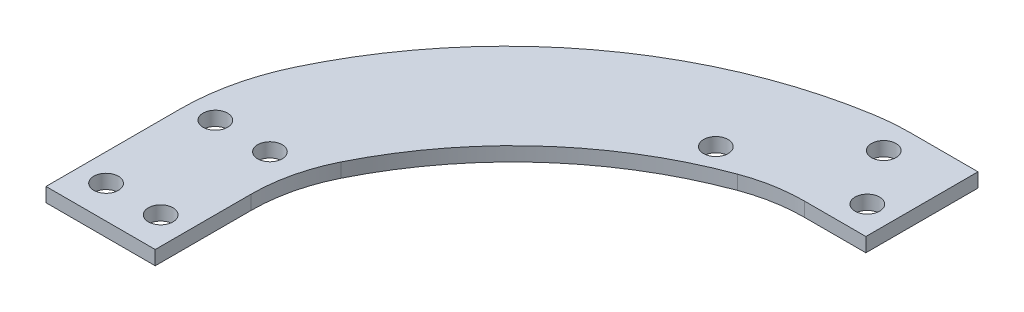
ISO-10303-21;
HEADER;
FILE_DESCRIPTION(('STEP AP214'),'2;1');
FILE_NAME('part.step','',(''),(''),'','','');
FILE_SCHEMA(('AUTOMOTIVE_DESIGN { 1 0 10303 214 1 1 1 1 }'));
ENDSEC;
DATA;
#1=APPLICATION_CONTEXT('core data for automotive mechanical design processes');
#2=APPLICATION_PROTOCOL_DEFINITION('international standard','automotive_design',2000,#1);
#3=PRODUCT_CONTEXT('',#1,'mechanical');
#4=PRODUCT('Part','Part','',(#3));
#5=PRODUCT_RELATED_PRODUCT_CATEGORY('part','',(#4));
#6=PRODUCT_DEFINITION_FORMATION('','',#4);
#7=PRODUCT_DEFINITION_CONTEXT('part definition',#1,'design');
#8=PRODUCT_DEFINITION('design','',#6,#7);
#9=PRODUCT_DEFINITION_SHAPE('','',#8);
#10=(LENGTH_UNIT() NAMED_UNIT(*) SI_UNIT(.MILLI.,.METRE.));
#11=(NAMED_UNIT(*) PLANE_ANGLE_UNIT() SI_UNIT($,.RADIAN.));
#12=(NAMED_UNIT(*) SI_UNIT($,.STERADIAN.) SOLID_ANGLE_UNIT());
#13=UNCERTAINTY_MEASURE_WITH_UNIT(LENGTH_MEASURE(1.E-05),#10,'distance_accuracy_value','');
#14=(GEOMETRIC_REPRESENTATION_CONTEXT(3) GLOBAL_UNCERTAINTY_ASSIGNED_CONTEXT((#13)) GLOBAL_UNIT_ASSIGNED_CONTEXT((#10,
#11,#12)) REPRESENTATION_CONTEXT('',''));
#15=CARTESIAN_POINT('',(0.,0.,0.));
#16=DIRECTION('',(0.,0.,1.));
#17=DIRECTION('',(1.,0.,0.));
#18=AXIS2_PLACEMENT_3D('',#15,#16,#17);
#19=CARTESIAN_POINT('',(60.7297478618746,2.58826,-31.65));
#20=DIRECTION('',(0.,-1.,0.));
#21=DIRECTION('',(0.,0.,-1.));
#22=AXIS2_PLACEMENT_3D('',#19,#20,#21);
#23=CYLINDRICAL_SURFACE('',#22,40.);
#24=CARTESIAN_POINT('',(60.7297478618746,0.,-31.65));
#25=DIRECTION('',(0.,1.,0.));
#26=DIRECTION('',(0.,0.,1.));
#27=AXIS2_PLACEMENT_3D('',#24,#25,#26);
#28=CIRCLE('',#27,40.);
#29=CARTESIAN_POINT('',(60.7297478618746,0.,-71.65));
#30=VERTEX_POINT('',#29);
#31=CARTESIAN_POINT('',(54.212761864157,0.,-71.1155405829637));
#32=VERTEX_POINT('',#31);
#33=EDGE_CURVE('E160',#30,#32,#28,.T.);
#34=ORIENTED_EDGE('',*,*,#33,.T.);
#35=DIRECTION('',(0.,-1.,0.));
#36=VECTOR('',#35,1.);
#37=CARTESIAN_POINT('',(54.212761864157,2.58826,-71.1155405829637));
#38=LINE('',#37,#36);
#39=CARTESIAN_POINT('',(54.212761864157,2.58826,-71.1155405829637));
#40=VERTEX_POINT('',#39);
#41=EDGE_CURVE('E11',#40,#32,#38,.T.);
#42=ORIENTED_EDGE('',*,*,#41,.F.);
#43=CARTESIAN_POINT('',(60.7297478618746,2.58826,-31.65));
#44=DIRECTION('',(0.,1.,0.));
#45=DIRECTION('',(0.,0.,1.));
#46=AXIS2_PLACEMENT_3D('',#43,#44,#45);
#47=CIRCLE('',#46,40.);
#48=CARTESIAN_POINT('',(60.7297478618746,2.58826,-71.65));
#49=VERTEX_POINT('',#48);
#50=EDGE_CURVE('E107',#49,#40,#47,.T.);
#51=ORIENTED_EDGE('',*,*,#50,.F.);
#52=DIRECTION('',(0.,-1.,0.));
#53=VECTOR('',#52,1.);
#54=CARTESIAN_POINT('',(60.7297478618746,2.58826,-71.65));
#55=LINE('',#54,#53);
#56=EDGE_CURVE('E159',#49,#30,#55,.T.);
#57=ORIENTED_EDGE('',*,*,#56,.T.);
#58=EDGE_LOOP('',(#34,#42,#51,#57));
#59=FACE_BOUND('',#58,.T.);
#60=ADVANCED_FACE('F40',(#59),#23,.T.);
#61=CARTESIAN_POINT('',(67.4957322096476,2.58826,9.32342390397192));
#62=DIRECTION('',(0.,-1.,0.));
#63=DIRECTION('',(0.,0.,-1.));
#64=AXIS2_PLACEMENT_3D('',#61,#62,#63);
#65=CYLINDRICAL_SURFACE('',#64,81.5283037290098);
#66=CARTESIAN_POINT('',(67.4957322096476,0.,9.32342390397192));
#67=DIRECTION('',(0.,1.,0.));
#68=DIRECTION('',(0.,0.,1.));
#69=AXIS2_PLACEMENT_3D('',#66,#67,#68);
#70=CIRCLE('',#69,81.5283037290098);
#71=CARTESIAN_POINT('',(-6.11583314774768,0.,-25.7222855989557));
#72=VERTEX_POINT('',#71);
#73=EDGE_CURVE('E163',#72,#32,#70,.F.);
#74=ORIENTED_EDGE('',*,*,#73,.F.);
#75=DIRECTION('',(0.,-1.,0.));
#76=VECTOR('',#75,1.);
#77=CARTESIAN_POINT('',(-6.11583314774768,2.58826,-25.7222855989557));
#78=LINE('',#77,#76);
#79=CARTESIAN_POINT('',(-6.11583314774768,2.58826,-25.7222855989557));
#80=VERTEX_POINT('',#79);
#81=EDGE_CURVE('E48',#80,#72,#78,.T.);
#82=ORIENTED_EDGE('',*,*,#81,.F.);
#83=CARTESIAN_POINT('',(67.4957322096476,2.58826,9.32342390397192));
#84=DIRECTION('',(0.,1.,0.));
#85=DIRECTION('',(0.,0.,1.));
#86=AXIS2_PLACEMENT_3D('',#83,#84,#85);
#87=CIRCLE('',#86,81.5283037290098);
#88=EDGE_CURVE('E220',#80,#40,#87,.F.);
#89=ORIENTED_EDGE('',*,*,#88,.T.);
#90=ORIENTED_EDGE('',*,*,#41,.T.);
#91=EDGE_LOOP('',(#74,#82,#89,#90));
#92=FACE_BOUND('',#91,.T.);
#93=ADVANCED_FACE('F219',(#92),#65,.T.);
#94=CARTESIAN_POINT('',(30.,2.58826,-8.52790872615073));
#95=DIRECTION('',(0.,-1.,0.));
#96=DIRECTION('',(0.,0.,-1.));
#97=AXIS2_PLACEMENT_3D('',#94,#95,#96);
#98=CYLINDRICAL_SURFACE('',#97,40.);
#99=CARTESIAN_POINT('',(30.,0.,-8.52790872615073));
#100=DIRECTION('',(0.,1.,0.));
#101=DIRECTION('',(0.,0.,1.));
#102=AXIS2_PLACEMENT_3D('',#99,#100,#101);
#103=CIRCLE('',#102,40.);
#104=CARTESIAN_POINT('',(-10.,0.,-8.52790872615073));
#105=VERTEX_POINT('',#104);
#106=EDGE_CURVE('E167',#72,#105,#103,.T.);
#107=ORIENTED_EDGE('',*,*,#106,.T.);
#108=DIRECTION('',(0.,-1.,0.));
#109=VECTOR('',#108,1.);
#110=CARTESIAN_POINT('',(-10.,2.58826,-8.52790872615073));
#111=LINE('',#110,#109);
#112=CARTESIAN_POINT('',(-10.,2.58826,-8.52790872615073));
#113=VERTEX_POINT('',#112);
#114=EDGE_CURVE('E204',#113,#105,#111,.T.);
#115=ORIENTED_EDGE('',*,*,#114,.F.);
#116=CARTESIAN_POINT('',(30.,2.58826,-8.52790872615073));
#117=DIRECTION('',(0.,1.,0.));
#118=DIRECTION('',(0.,0.,1.));
#119=AXIS2_PLACEMENT_3D('',#116,#117,#118);
#120=CIRCLE('',#119,40.);
#121=EDGE_CURVE('E210',#80,#113,#120,.T.);
#122=ORIENTED_EDGE('',*,*,#121,.F.);
#123=ORIENTED_EDGE('',*,*,#81,.T.);
#124=EDGE_LOOP('',(#107,#115,#122,#123));
#125=FACE_BOUND('',#124,.T.);
#126=ADVANCED_FACE('F208',(#125),#98,.T.);
#127=CARTESIAN_POINT('',(-10.,2.58826,0.));
#128=DIRECTION('',(-1.,0.,0.));
#129=DIRECTION('',(0.,0.,1.));
#130=AXIS2_PLACEMENT_3D('',#127,#128,#129);
#131=PLANE('',#130);
#132=DIRECTION('',(0.,0.,-1.));
#133=VECTOR('',#132,1.);
#134=CARTESIAN_POINT('',(-10.,0.,0.));
#135=LINE('',#134,#133);
#136=CARTESIAN_POINT('',(-10.,0.,16.));
#137=VERTEX_POINT('',#136);
#138=EDGE_CURVE('E170',#137,#105,#135,.T.);
#139=ORIENTED_EDGE('',*,*,#138,.F.);
#140=DIRECTION('',(0.,-1.,0.));
#141=VECTOR('',#140,1.);
#142=CARTESIAN_POINT('',(-10.,2.58826,16.));
#143=LINE('',#142,#141);
#144=CARTESIAN_POINT('',(-10.,2.58826,16.));
#145=VERTEX_POINT('',#144);
#146=EDGE_CURVE('E202',#145,#137,#143,.T.);
#147=ORIENTED_EDGE('',*,*,#146,.F.);
#148=DIRECTION('',(0.,0.,-1.));
#149=VECTOR('',#148,1.);
#150=CARTESIAN_POINT('',(-10.,2.58826,0.));
#151=LINE('',#150,#149);
#152=EDGE_CURVE('E251',#145,#113,#151,.T.);
#153=ORIENTED_EDGE('',*,*,#152,.T.);
#154=ORIENTED_EDGE('',*,*,#114,.T.);
#155=EDGE_LOOP('',(#139,#147,#153,#154));
#156=FACE_BOUND('',#155,.T.);
#157=ADVANCED_FACE('F250',(#156),#131,.T.);
#158=CARTESIAN_POINT('',(0.,2.58826,16.));
#159=DIRECTION('',(0.,0.,-1.));
#160=DIRECTION('',(-1.,0.,0.));
#161=AXIS2_PLACEMENT_3D('',#158,#159,#160);
#162=PLANE('',#161);
#163=DIRECTION('',(1.,0.,0.));
#164=VECTOR('',#163,1.);
#165=CARTESIAN_POINT('',(0.,0.,16.));
#166=LINE('',#165,#164);
#167=CARTESIAN_POINT('',(10.,0.,16.));
#168=VERTEX_POINT('',#167);
#169=EDGE_CURVE('E173',#137,#168,#166,.T.);
#170=ORIENTED_EDGE('',*,*,#169,.T.);
#171=DIRECTION('',(0.,-1.,0.));
#172=VECTOR('',#171,1.);
#173=CARTESIAN_POINT('',(10.,2.58826,16.));
#174=LINE('',#173,#172);
#175=CARTESIAN_POINT('',(10.,2.58826,16.));
#176=VERTEX_POINT('',#175);
#177=EDGE_CURVE('E199',#176,#168,#174,.T.);
#178=ORIENTED_EDGE('',*,*,#177,.F.);
#179=DIRECTION('',(1.,0.,0.));
#180=VECTOR('',#179,1.);
#181=CARTESIAN_POINT('',(0.,2.58826,16.));
#182=LINE('',#181,#180);
#183=EDGE_CURVE('E246',#145,#176,#182,.T.);
#184=ORIENTED_EDGE('',*,*,#183,.F.);
#185=ORIENTED_EDGE('',*,*,#146,.T.);
#186=EDGE_LOOP('',(#170,#178,#184,#185));
#187=FACE_BOUND('',#186,.T.);
#188=ADVANCED_FACE('F245',(#187),#162,.F.);
#189=CARTESIAN_POINT('',(10.,2.58826,0.));
#190=DIRECTION('',(-1.,0.,0.));
#191=DIRECTION('',(0.,0.,1.));
#192=AXIS2_PLACEMENT_3D('',#189,#190,#191);
#193=PLANE('',#192);
#194=DIRECTION('',(0.,0.,-1.));
#195=VECTOR('',#194,1.);
#196=CARTESIAN_POINT('',(10.,0.,0.));
#197=LINE('',#196,#195);
#198=CARTESIAN_POINT('',(10.,0.,-1.57110834080067));
#199=VERTEX_POINT('',#198);
#200=EDGE_CURVE('E175',#168,#199,#197,.T.);
#201=ORIENTED_EDGE('',*,*,#200,.T.);
#202=DIRECTION('',(0.,-1.,0.));
#203=VECTOR('',#202,1.);
#204=CARTESIAN_POINT('',(10.,2.58826,-1.57110834080067));
#205=LINE('',#204,#203);
#206=CARTESIAN_POINT('',(10.,2.58826,-1.57110834080067));
#207=VERTEX_POINT('',#206);
#208=EDGE_CURVE('E196',#207,#199,#205,.T.);
#209=ORIENTED_EDGE('',*,*,#208,.F.);
#210=DIRECTION('',(0.,0.,-1.));
#211=VECTOR('',#210,1.);
#212=CARTESIAN_POINT('',(10.,2.58826,0.));
#213=LINE('',#212,#211);
#214=EDGE_CURVE('E242',#176,#207,#213,.T.);
#215=ORIENTED_EDGE('',*,*,#214,.F.);
#216=ORIENTED_EDGE('',*,*,#177,.T.);
#217=EDGE_LOOP('',(#201,#209,#215,#216));
#218=FACE_BOUND('',#217,.T.);
#219=ADVANCED_FACE('F239',(#218),#193,.F.);
#220=CARTESIAN_POINT('',(40.,2.58826,-1.57110834080067));
#221=DIRECTION('',(0.,-1.,0.));
#222=DIRECTION('',(0.,0.,-1.));
#223=AXIS2_PLACEMENT_3D('',#220,#221,#222);
#224=CYLINDRICAL_SURFACE('',#223,30.);
#225=CARTESIAN_POINT('',(40.,0.,-1.57110834080067));
#226=DIRECTION('',(0.,1.,0.));
#227=DIRECTION('',(0.,0.,1.));
#228=AXIS2_PLACEMENT_3D('',#225,#226,#227);
#229=CIRCLE('',#228,30.);
#230=CARTESIAN_POINT('',(13.1197255045627,0.,-14.8921759800683));
#231=VERTEX_POINT('',#230);
#232=EDGE_CURVE('E177',#199,#231,#229,.F.);
#233=ORIENTED_EDGE('',*,*,#232,.T.);
#234=DIRECTION('',(0.,-1.,0.));
#235=VECTOR('',#234,1.);
#236=CARTESIAN_POINT('',(13.1197255045627,2.58826,-14.8921759800683));
#237=LINE('',#236,#235);
#238=CARTESIAN_POINT('',(13.1197255045627,2.58826,-14.8921759800683));
#239=VERTEX_POINT('',#238);
#240=EDGE_CURVE('E193',#239,#231,#237,.T.);
#241=ORIENTED_EDGE('',*,*,#240,.F.);
#242=CARTESIAN_POINT('',(40.,2.58826,-1.57110834080067));
#243=DIRECTION('',(0.,1.,0.));
#244=DIRECTION('',(0.,0.,1.));
#245=AXIS2_PLACEMENT_3D('',#242,#243,#244);
#246=CIRCLE('',#245,30.);
#247=EDGE_CURVE('E235',#207,#239,#246,.F.);
#248=ORIENTED_EDGE('',*,*,#247,.F.);
#249=ORIENTED_EDGE('',*,*,#208,.T.);
#250=EDGE_LOOP('',(#233,#241,#248,#249));
#251=FACE_BOUND('',#250,.T.);
#252=ADVANCED_FACE('F234',(#251),#224,.F.);
#253=CARTESIAN_POINT('',(75.4563333945922,2.58826,16.));
#254=DIRECTION('',(0.,-1.,0.));
#255=DIRECTION('',(0.,0.,-1.));
#256=AXIS2_PLACEMENT_3D('',#253,#254,#255);
#257=CYLINDRICAL_SURFACE('',#256,69.5713965651028);
#258=CARTESIAN_POINT('',(75.4563333945922,0.,16.));
#259=DIRECTION('',(0.,1.,0.));
#260=DIRECTION('',(0.,0.,1.));
#261=AXIS2_PLACEMENT_3D('',#258,#259,#260);
#262=CIRCLE('',#261,69.5713965651028);
#263=CARTESIAN_POINT('',(51.3500946491756,0.,-49.2615390070428));
#264=VERTEX_POINT('',#263);
#265=EDGE_CURVE('E179',#231,#264,#262,.F.);
#266=ORIENTED_EDGE('',*,*,#265,.T.);
#267=DIRECTION('',(0.,-1.,0.));
#268=VECTOR('',#267,1.);
#269=CARTESIAN_POINT('',(51.3500946491756,2.58826,-49.2615390070428));
#270=LINE('',#269,#268);
#271=CARTESIAN_POINT('',(51.3500946491756,2.58826,-49.2615390070428));
#272=VERTEX_POINT('',#271);
#273=EDGE_CURVE('E190',#272,#264,#270,.T.);
#274=ORIENTED_EDGE('',*,*,#273,.F.);
#275=CARTESIAN_POINT('',(75.4563333945922,2.58826,16.));
#276=DIRECTION('',(0.,1.,0.));
#277=DIRECTION('',(0.,0.,1.));
#278=AXIS2_PLACEMENT_3D('',#275,#276,#277);
#279=CIRCLE('',#278,69.5713965651028);
#280=EDGE_CURVE('E154',#239,#272,#279,.F.);
#281=ORIENTED_EDGE('',*,*,#280,.F.);
#282=ORIENTED_EDGE('',*,*,#240,.T.);
#283=EDGE_LOOP('',(#266,#274,#281,#282));
#284=FACE_BOUND('',#283,.T.);
#285=ADVANCED_FACE('F230',(#284),#257,.F.);
#286=CARTESIAN_POINT('',(61.7449867753637,2.58826,-21.12));
#287=DIRECTION('',(0.,-1.,0.));
#288=DIRECTION('',(0.,0.,-1.));
#289=AXIS2_PLACEMENT_3D('',#286,#287,#288);
#290=CYLINDRICAL_SURFACE('',#289,30.);
#291=CARTESIAN_POINT('',(61.7449867753637,0.,-21.12));
#292=DIRECTION('',(0.,1.,0.));
#293=DIRECTION('',(0.,0.,1.));
#294=AXIS2_PLACEMENT_3D('',#291,#292,#293);
#295=CIRCLE('',#294,30.);
#296=CARTESIAN_POINT('',(61.7449867753637,0.,-51.12));
#297=VERTEX_POINT('',#296);
#298=EDGE_CURVE('E181',#264,#297,#295,.F.);
#299=ORIENTED_EDGE('',*,*,#298,.T.);
#300=DIRECTION('',(0.,-1.,0.));
#301=VECTOR('',#300,1.);
#302=CARTESIAN_POINT('',(61.7449867753637,2.58826,-51.12));
#303=LINE('',#302,#301);
#304=CARTESIAN_POINT('',(61.7449867753637,2.58826,-51.12));
#305=VERTEX_POINT('',#304);
#306=EDGE_CURVE('E143',#305,#297,#303,.T.);
#307=ORIENTED_EDGE('',*,*,#306,.F.);
#308=CARTESIAN_POINT('',(61.7449867753637,2.58826,-21.12));
#309=DIRECTION('',(0.,1.,0.));
#310=DIRECTION('',(0.,0.,1.));
#311=AXIS2_PLACEMENT_3D('',#308,#309,#310);
#312=CIRCLE('',#311,30.);
#313=EDGE_CURVE('E151',#272,#305,#312,.F.);
#314=ORIENTED_EDGE('',*,*,#313,.F.);
#315=ORIENTED_EDGE('',*,*,#273,.T.);
#316=EDGE_LOOP('',(#299,#307,#314,#315));
#317=FACE_BOUND('',#316,.T.);
#318=ADVANCED_FACE('F226',(#317),#290,.F.);
#319=CARTESIAN_POINT('',(0.,2.58826,-51.12));
#320=DIRECTION('',(0.,0.,1.));
#321=DIRECTION('',(1.,0.,0.));
#322=AXIS2_PLACEMENT_3D('',#319,#320,#321);
#323=PLANE('',#322);
#324=DIRECTION('',(-1.,0.,0.));
#325=VECTOR('',#324,1.);
#326=CARTESIAN_POINT('',(0.,0.,-51.12));
#327=LINE('',#326,#325);
#328=CARTESIAN_POINT('',(73.,0.,-51.12));
#329=VERTEX_POINT('',#328);
#330=EDGE_CURVE('E142',#329,#297,#327,.T.);
#331=ORIENTED_EDGE('',*,*,#330,.F.);
#332=DIRECTION('',(0.,-1.,0.));
#333=VECTOR('',#332,1.);
#334=CARTESIAN_POINT('',(73.,2.58826,-51.12));
#335=LINE('',#334,#333);
#336=CARTESIAN_POINT('',(73.,2.58826,-51.12));
#337=VERTEX_POINT('',#336);
#338=EDGE_CURVE('E136',#337,#329,#335,.T.);
#339=ORIENTED_EDGE('',*,*,#338,.F.);
#340=DIRECTION('',(-1.,0.,0.));
#341=VECTOR('',#340,1.);
#342=CARTESIAN_POINT('',(0.,2.58826,-51.12));
#343=LINE('',#342,#341);
#344=EDGE_CURVE('E140',#337,#305,#343,.T.);
#345=ORIENTED_EDGE('',*,*,#344,.T.);
#346=ORIENTED_EDGE('',*,*,#306,.T.);
#347=EDGE_LOOP('',(#331,#339,#345,#346));
#348=FACE_BOUND('',#347,.T.);
#349=ADVANCED_FACE('F138',(#348),#323,.T.);
#350=CARTESIAN_POINT('',(73.,2.58826,0.));
#351=DIRECTION('',(-1.,0.,0.));
#352=DIRECTION('',(0.,0.,1.));
#353=AXIS2_PLACEMENT_3D('',#350,#351,#352);
#354=PLANE('',#353);
#355=DIRECTION('',(0.,0.,-1.));
#356=VECTOR('',#355,1.);
#357=CARTESIAN_POINT('',(73.,0.,0.));
#358=LINE('',#357,#356);
#359=CARTESIAN_POINT('',(73.,0.,-71.65));
#360=VERTEX_POINT('',#359);
#361=EDGE_CURVE('E95',#329,#360,#358,.T.);
#362=ORIENTED_EDGE('',*,*,#361,.T.);
#363=DIRECTION('',(0.,-1.,0.));
#364=VECTOR('',#363,1.);
#365=CARTESIAN_POINT('',(73.,2.58826,-71.65));
#366=LINE('',#365,#364);
#367=CARTESIAN_POINT('',(73.,2.58826,-71.65));
#368=VERTEX_POINT('',#367);
#369=EDGE_CURVE('E144',#368,#360,#366,.T.);
#370=ORIENTED_EDGE('',*,*,#369,.F.);
#371=DIRECTION('',(0.,0.,-1.));
#372=VECTOR('',#371,1.);
#373=CARTESIAN_POINT('',(73.,2.58826,0.));
#374=LINE('',#373,#372);
#375=EDGE_CURVE('E146',#337,#368,#374,.T.);
#376=ORIENTED_EDGE('',*,*,#375,.F.);
#377=ORIENTED_EDGE('',*,*,#338,.T.);
#378=EDGE_LOOP('',(#362,#370,#376,#377));
#379=FACE_BOUND('',#378,.T.);
#380=ADVANCED_FACE('F147',(#379),#354,.F.);
#381=CARTESIAN_POINT('',(0.,2.58826,-71.65));
#382=DIRECTION('',(0.,0.,1.));
#383=DIRECTION('',(1.,0.,0.));
#384=AXIS2_PLACEMENT_3D('',#381,#382,#383);
#385=PLANE('',#384);
#386=DIRECTION('',(-1.,0.,0.));
#387=VECTOR('',#386,1.);
#388=CARTESIAN_POINT('',(0.,0.,-71.65));
#389=LINE('',#388,#387);
#390=EDGE_CURVE('E101',#360,#30,#389,.T.);
#391=ORIENTED_EDGE('',*,*,#390,.T.);
#392=ORIENTED_EDGE('',*,*,#56,.F.);
#393=DIRECTION('',(-1.,0.,0.));
#394=VECTOR('',#393,1.);
#395=CARTESIAN_POINT('',(0.,2.58826,-71.65));
#396=LINE('',#395,#394);
#397=EDGE_CURVE('E56',#368,#49,#396,.T.);
#398=ORIENTED_EDGE('',*,*,#397,.F.);
#399=ORIENTED_EDGE('',*,*,#369,.T.);
#400=EDGE_LOOP('',(#391,#392,#398,#399));
#401=FACE_BOUND('',#400,.T.);
#402=ADVANCED_FACE('F327',(#401),#385,.F.);
#403=CARTESIAN_POINT('',(0.,2.58826,0.));
#404=DIRECTION('',(0.,1.,0.));
#405=DIRECTION('',(0.,0.,1.));
#406=AXIS2_PLACEMENT_3D('',#403,#404,#405);
#407=PLANE('',#406);
#408=CARTESIAN_POINT('',(45.,2.58826,-51.65));
#409=DIRECTION('',(0.,1.,0.));
#410=DIRECTION('',(0.,0.,1.));
#411=AXIS2_PLACEMENT_3D('',#408,#409,#410);
#412=CIRCLE('',#411,2.25);
#413=CARTESIAN_POINT('',(45.,2.58826,-49.4));
#414=VERTEX_POINT('',#413);
#415=EDGE_CURVE('E295',#414,#414,#412,.T.);
#416=ORIENTED_EDGE('',*,*,#415,.F.);
#417=EDGE_LOOP('',(#416));
#418=FACE_BOUND('',#417,.T.);
#419=CARTESIAN_POINT('',(61.,2.58826,-66.385));
#420=DIRECTION('',(0.,1.,0.));
#421=DIRECTION('',(0.,0.,1.));
#422=AXIS2_PLACEMENT_3D('',#419,#420,#421);
#423=CIRCLE('',#422,2.24999999999999);
#424=CARTESIAN_POINT('',(61.,2.58826,-64.135));
#425=VERTEX_POINT('',#424);
#426=EDGE_CURVE('E292',#425,#425,#423,.T.);
#427=ORIENTED_EDGE('',*,*,#426,.F.);
#428=EDGE_LOOP('',(#427));
#429=FACE_BOUND('',#428,.T.);
#430=CARTESIAN_POINT('',(68.,2.58826,-56.385));
#431=DIRECTION('',(0.,1.,0.));
#432=DIRECTION('',(0.,0.,1.));
#433=AXIS2_PLACEMENT_3D('',#430,#431,#432);
#434=CIRCLE('',#433,2.24999999999999);
#435=CARTESIAN_POINT('',(68.,2.58826,-54.135));
#436=VERTEX_POINT('',#435);
#437=EDGE_CURVE('E286',#436,#436,#434,.T.);
#438=ORIENTED_EDGE('',*,*,#437,.F.);
#439=EDGE_LOOP('',(#438));
#440=FACE_BOUND('',#439,.T.);
#441=CARTESIAN_POINT('',(-5.,2.58826,-10.));
#442=DIRECTION('',(0.,1.,0.));
#443=DIRECTION('',(0.,0.,1.));
#444=AXIS2_PLACEMENT_3D('',#441,#442,#443);
#445=CIRCLE('',#444,2.25);
#446=CARTESIAN_POINT('',(-5.,2.58826,-7.75));
#447=VERTEX_POINT('',#446);
#448=EDGE_CURVE('E280',#447,#447,#445,.T.);
#449=ORIENTED_EDGE('',*,*,#448,.F.);
#450=EDGE_LOOP('',(#449));
#451=FACE_BOUND('',#450,.T.);
#452=CARTESIAN_POINT('',(5.,2.58826,-10.));
#453=DIRECTION('',(0.,1.,0.));
#454=DIRECTION('',(0.,0.,1.));
#455=AXIS2_PLACEMENT_3D('',#452,#453,#454);
#456=CIRCLE('',#455,2.25);
#457=CARTESIAN_POINT('',(5.,2.58826,-7.75));
#458=VERTEX_POINT('',#457);
#459=EDGE_CURVE('E274',#458,#458,#456,.T.);
#460=ORIENTED_EDGE('',*,*,#459,.F.);
#461=EDGE_LOOP('',(#460));
#462=FACE_BOUND('',#461,.T.);
#463=CARTESIAN_POINT('',(5.,2.58826,10.));
#464=DIRECTION('',(0.,1.,0.));
#465=DIRECTION('',(0.,0.,1.));
#466=AXIS2_PLACEMENT_3D('',#463,#464,#465);
#467=CIRCLE('',#466,2.25);
#468=CARTESIAN_POINT('',(5.,2.58826,12.25));
#469=VERTEX_POINT('',#468);
#470=EDGE_CURVE('E268',#469,#469,#467,.T.);
#471=ORIENTED_EDGE('',*,*,#470,.F.);
#472=EDGE_LOOP('',(#471));
#473=FACE_BOUND('',#472,.T.);
#474=CARTESIAN_POINT('',(-5.,2.58826,10.));
#475=DIRECTION('',(0.,1.,0.));
#476=DIRECTION('',(0.,0.,1.));
#477=AXIS2_PLACEMENT_3D('',#474,#475,#476);
#478=CIRCLE('',#477,2.25);
#479=CARTESIAN_POINT('',(-5.,2.58826,12.25));
#480=VERTEX_POINT('',#479);
#481=EDGE_CURVE('E262',#480,#480,#478,.T.);
#482=ORIENTED_EDGE('',*,*,#481,.F.);
#483=EDGE_LOOP('',(#482));
#484=FACE_BOUND('',#483,.T.);
#485=ORIENTED_EDGE('',*,*,#50,.T.);
#486=ORIENTED_EDGE('',*,*,#88,.F.);
#487=ORIENTED_EDGE('',*,*,#121,.T.);
#488=ORIENTED_EDGE('',*,*,#152,.F.);
#489=ORIENTED_EDGE('',*,*,#183,.T.);
#490=ORIENTED_EDGE('',*,*,#214,.T.);
#491=ORIENTED_EDGE('',*,*,#247,.T.);
#492=ORIENTED_EDGE('',*,*,#280,.T.);
#493=ORIENTED_EDGE('',*,*,#313,.T.);
#494=ORIENTED_EDGE('',*,*,#344,.F.);
#495=ORIENTED_EDGE('',*,*,#375,.T.);
#496=ORIENTED_EDGE('',*,*,#397,.T.);
#497=EDGE_LOOP('',(#485,#486,#487,#488,#489,#490,#491,#492,#493,#494,#495,#496));
#498=FACE_BOUND('',#497,.T.);
#499=ADVANCED_FACE('F149',(#418,#429,#440,#451,#462,#473,#484,#498),#407,.T.);
#500=CARTESIAN_POINT('',(0.,0.,0.));
#501=DIRECTION('',(0.,1.,0.));
#502=DIRECTION('',(0.,0.,1.));
#503=AXIS2_PLACEMENT_3D('',#500,#501,#502);
#504=PLANE('',#503);
#505=CARTESIAN_POINT('',(45.,0.,-51.65));
#506=DIRECTION('',(0.,-1.,0.));
#507=DIRECTION('',(0.,0.,-1.));
#508=AXIS2_PLACEMENT_3D('',#505,#506,#507);
#509=CIRCLE('',#508,2.25);
#510=CARTESIAN_POINT('',(45.,0.,-53.9));
#511=VERTEX_POINT('',#510);
#512=EDGE_CURVE('E298',#511,#511,#509,.T.);
#513=ORIENTED_EDGE('',*,*,#512,.F.);
#514=EDGE_LOOP('',(#513));
#515=FACE_BOUND('',#514,.T.);
#516=CARTESIAN_POINT('',(61.,0.,-66.385));
#517=DIRECTION('',(0.,1.,0.));
#518=DIRECTION('',(0.,0.,1.));
#519=AXIS2_PLACEMENT_3D('',#516,#517,#518);
#520=CIRCLE('',#519,2.25);
#521=CARTESIAN_POINT('',(61.,0.,-64.135));
#522=VERTEX_POINT('',#521);
#523=EDGE_CURVE('E289',#522,#522,#520,.T.);
#524=ORIENTED_EDGE('',*,*,#523,.T.);
#525=EDGE_LOOP('',(#524));
#526=FACE_BOUND('',#525,.T.);
#527=CARTESIAN_POINT('',(68.,0.,-56.385));
#528=DIRECTION('',(0.,1.,0.));
#529=DIRECTION('',(0.,0.,1.));
#530=AXIS2_PLACEMENT_3D('',#527,#528,#529);
#531=CIRCLE('',#530,2.25);
#532=CARTESIAN_POINT('',(68.,0.,-54.135));
#533=VERTEX_POINT('',#532);
#534=EDGE_CURVE('E283',#533,#533,#531,.T.);
#535=ORIENTED_EDGE('',*,*,#534,.T.);
#536=EDGE_LOOP('',(#535));
#537=FACE_BOUND('',#536,.T.);
#538=CARTESIAN_POINT('',(-5.,0.,-10.));
#539=DIRECTION('',(0.,1.,0.));
#540=DIRECTION('',(0.,0.,1.));
#541=AXIS2_PLACEMENT_3D('',#538,#539,#540);
#542=CIRCLE('',#541,2.25);
#543=CARTESIAN_POINT('',(-5.,0.,-7.75));
#544=VERTEX_POINT('',#543);
#545=EDGE_CURVE('E277',#544,#544,#542,.T.);
#546=ORIENTED_EDGE('',*,*,#545,.T.);
#547=EDGE_LOOP('',(#546));
#548=FACE_BOUND('',#547,.T.);
#549=CARTESIAN_POINT('',(5.,0.,-10.));
#550=DIRECTION('',(0.,1.,0.));
#551=DIRECTION('',(0.,0.,1.));
#552=AXIS2_PLACEMENT_3D('',#549,#550,#551);
#553=CIRCLE('',#552,2.25);
#554=CARTESIAN_POINT('',(5.,0.,-7.75));
#555=VERTEX_POINT('',#554);
#556=EDGE_CURVE('E271',#555,#555,#553,.T.);
#557=ORIENTED_EDGE('',*,*,#556,.T.);
#558=EDGE_LOOP('',(#557));
#559=FACE_BOUND('',#558,.T.);
#560=CARTESIAN_POINT('',(5.,0.,10.));
#561=DIRECTION('',(0.,1.,0.));
#562=DIRECTION('',(0.,0.,1.));
#563=AXIS2_PLACEMENT_3D('',#560,#561,#562);
#564=CIRCLE('',#563,2.25);
#565=CARTESIAN_POINT('',(5.,0.,12.25));
#566=VERTEX_POINT('',#565);
#567=EDGE_CURVE('E265',#566,#566,#564,.T.);
#568=ORIENTED_EDGE('',*,*,#567,.T.);
#569=EDGE_LOOP('',(#568));
#570=FACE_BOUND('',#569,.T.);
#571=CARTESIAN_POINT('',(-5.,0.,10.));
#572=DIRECTION('',(0.,1.,0.));
#573=DIRECTION('',(0.,0.,1.));
#574=AXIS2_PLACEMENT_3D('',#571,#572,#573);
#575=CIRCLE('',#574,2.25);
#576=CARTESIAN_POINT('',(-5.,0.,12.25));
#577=VERTEX_POINT('',#576);
#578=EDGE_CURVE('E164',#577,#577,#575,.T.);
#579=ORIENTED_EDGE('',*,*,#578,.T.);
#580=EDGE_LOOP('',(#579));
#581=FACE_BOUND('',#580,.T.);
#582=ORIENTED_EDGE('',*,*,#33,.F.);
#583=ORIENTED_EDGE('',*,*,#390,.F.);
#584=ORIENTED_EDGE('',*,*,#361,.F.);
#585=ORIENTED_EDGE('',*,*,#330,.T.);
#586=ORIENTED_EDGE('',*,*,#298,.F.);
#587=ORIENTED_EDGE('',*,*,#265,.F.);
#588=ORIENTED_EDGE('',*,*,#232,.F.);
#589=ORIENTED_EDGE('',*,*,#200,.F.);
#590=ORIENTED_EDGE('',*,*,#169,.F.);
#591=ORIENTED_EDGE('',*,*,#138,.T.);
#592=ORIENTED_EDGE('',*,*,#106,.F.);
#593=ORIENTED_EDGE('',*,*,#73,.T.);
#594=EDGE_LOOP('',(#582,#583,#584,#585,#586,#587,#588,#589,#590,#591,#592,#593));
#595=FACE_BOUND('',#594,.T.);
#596=ADVANCED_FACE('F216',(#515,#526,#537,#548,#559,#570,#581,#595),#504,.F.);
#597=CARTESIAN_POINT('',(-5.,2.58826,10.));
#598=DIRECTION('',(0.,1.,0.));
#599=DIRECTION('',(0.,0.,1.));
#600=AXIS2_PLACEMENT_3D('',#597,#598,#599);
#601=CYLINDRICAL_SURFACE('',#600,2.25);
#602=ORIENTED_EDGE('',*,*,#578,.F.);
#603=EDGE_LOOP('',(#602));
#604=FACE_BOUND('',#603,.T.);
#605=ORIENTED_EDGE('',*,*,#481,.T.);
#606=EDGE_LOOP('',(#605));
#607=FACE_BOUND('',#606,.T.);
#608=ADVANCED_FACE('F306',(#604,#607),#601,.F.);
#609=CARTESIAN_POINT('',(5.,2.58826,10.));
#610=DIRECTION('',(0.,1.,0.));
#611=DIRECTION('',(0.,0.,1.));
#612=AXIS2_PLACEMENT_3D('',#609,#610,#611);
#613=CYLINDRICAL_SURFACE('',#612,2.25);
#614=ORIENTED_EDGE('',*,*,#567,.F.);
#615=EDGE_LOOP('',(#614));
#616=FACE_BOUND('',#615,.T.);
#617=ORIENTED_EDGE('',*,*,#470,.T.);
#618=EDGE_LOOP('',(#617));
#619=FACE_BOUND('',#618,.T.);
#620=ADVANCED_FACE('F322',(#616,#619),#613,.F.);
#621=CARTESIAN_POINT('',(5.,2.58826,-10.));
#622=DIRECTION('',(0.,1.,0.));
#623=DIRECTION('',(0.,0.,1.));
#624=AXIS2_PLACEMENT_3D('',#621,#622,#623);
#625=CYLINDRICAL_SURFACE('',#624,2.25);
#626=ORIENTED_EDGE('',*,*,#556,.F.);
#627=EDGE_LOOP('',(#626));
#628=FACE_BOUND('',#627,.T.);
#629=ORIENTED_EDGE('',*,*,#459,.T.);
#630=EDGE_LOOP('',(#629));
#631=FACE_BOUND('',#630,.T.);
#632=ADVANCED_FACE('F390',(#628,#631),#625,.F.);
#633=CARTESIAN_POINT('',(-5.,2.58826,-10.));
#634=DIRECTION('',(0.,1.,0.));
#635=DIRECTION('',(0.,0.,1.));
#636=AXIS2_PLACEMENT_3D('',#633,#634,#635);
#637=CYLINDRICAL_SURFACE('',#636,2.25);
#638=ORIENTED_EDGE('',*,*,#545,.F.);
#639=EDGE_LOOP('',(#638));
#640=FACE_BOUND('',#639,.T.);
#641=ORIENTED_EDGE('',*,*,#448,.T.);
#642=EDGE_LOOP('',(#641));
#643=FACE_BOUND('',#642,.T.);
#644=ADVANCED_FACE('F398',(#640,#643),#637,.F.);
#645=CARTESIAN_POINT('',(68.,2.58826,-56.385));
#646=DIRECTION('',(0.,1.,0.));
#647=DIRECTION('',(0.,0.,1.));
#648=AXIS2_PLACEMENT_3D('',#645,#646,#647);
#649=CYLINDRICAL_SURFACE('',#648,2.25);
#650=ORIENTED_EDGE('',*,*,#534,.F.);
#651=EDGE_LOOP('',(#650));
#652=FACE_BOUND('',#651,.T.);
#653=ORIENTED_EDGE('',*,*,#437,.T.);
#654=EDGE_LOOP('',(#653));
#655=FACE_BOUND('',#654,.T.);
#656=ADVANCED_FACE('F406',(#652,#655),#649,.F.);
#657=CARTESIAN_POINT('',(61.,2.58826,-66.385));
#658=DIRECTION('',(0.,1.,0.));
#659=DIRECTION('',(0.,0.,1.));
#660=AXIS2_PLACEMENT_3D('',#657,#658,#659);
#661=CYLINDRICAL_SURFACE('',#660,2.25);
#662=ORIENTED_EDGE('',*,*,#523,.F.);
#663=EDGE_LOOP('',(#662));
#664=FACE_BOUND('',#663,.T.);
#665=ORIENTED_EDGE('',*,*,#426,.T.);
#666=EDGE_LOOP('',(#665));
#667=FACE_BOUND('',#666,.T.);
#668=ADVANCED_FACE('F414',(#664,#667),#661,.F.);
#669=CARTESIAN_POINT('',(45.,0.,-51.65));
#670=DIRECTION('',(0.,-1.,0.));
#671=DIRECTION('',(0.,0.,-1.));
#672=AXIS2_PLACEMENT_3D('',#669,#670,#671);
#673=CYLINDRICAL_SURFACE('',#672,2.25);
#674=ORIENTED_EDGE('',*,*,#415,.T.);
#675=EDGE_LOOP('',(#674));
#676=FACE_BOUND('',#675,.T.);
#677=ORIENTED_EDGE('',*,*,#512,.T.);
#678=EDGE_LOOP('',(#677));
#679=FACE_BOUND('',#678,.T.);
#680=ADVANCED_FACE('F302',(#676,#679),#673,.F.);
#681=CLOSED_SHELL('',(#60,#93,#126,#157,#188,#219,#252,#285,#318,#349,#380,#402,#499,#596,#608,
#620,#632,#644,#656,#668,#680));
#682=MANIFOLD_SOLID_BREP('B2',#681);
#683=ADVANCED_BREP_SHAPE_REPRESENTATION('',(#18,#682),#14);
#684=SHAPE_DEFINITION_REPRESENTATION(#9,#683);
ENDSEC;
END-ISO-10303-21;
